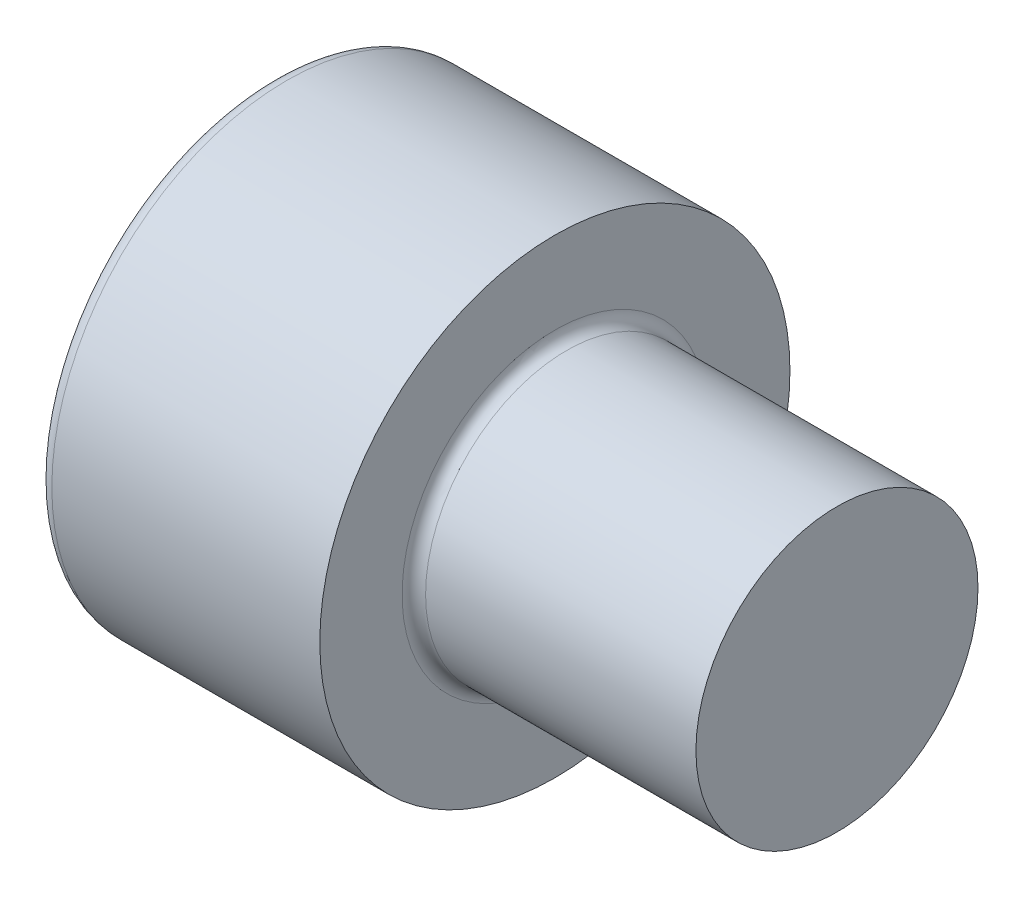
ISO-10303-21;
HEADER;
FILE_DESCRIPTION(('STEP AP214'),'2;1');
FILE_NAME('part.step','',(''),(''),'','','');
FILE_SCHEMA(('AUTOMOTIVE_DESIGN { 1 0 10303 214 1 1 1 1 }'));
ENDSEC;
DATA;
#1=APPLICATION_CONTEXT('core data for automotive mechanical design processes');
#2=APPLICATION_PROTOCOL_DEFINITION('international standard','automotive_design',2000,#1);
#3=PRODUCT_CONTEXT('',#1,'mechanical');
#4=PRODUCT('Part','Part','',(#3));
#5=PRODUCT_RELATED_PRODUCT_CATEGORY('part','',(#4));
#6=PRODUCT_DEFINITION_FORMATION('','',#4);
#7=PRODUCT_DEFINITION_CONTEXT('part definition',#1,'design');
#8=PRODUCT_DEFINITION('design','',#6,#7);
#9=PRODUCT_DEFINITION_SHAPE('','',#8);
#10=(LENGTH_UNIT() NAMED_UNIT(*) SI_UNIT(.MILLI.,.METRE.));
#11=(NAMED_UNIT(*) PLANE_ANGLE_UNIT() SI_UNIT($,.RADIAN.));
#12=(NAMED_UNIT(*) SI_UNIT($,.STERADIAN.) SOLID_ANGLE_UNIT());
#13=UNCERTAINTY_MEASURE_WITH_UNIT(LENGTH_MEASURE(1.E-05),#10,'distance_accuracy_value','');
#14=(GEOMETRIC_REPRESENTATION_CONTEXT(3) GLOBAL_UNCERTAINTY_ASSIGNED_CONTEXT((#13)) GLOBAL_UNIT_ASSIGNED_CONTEXT((#10,
#11,#12)) REPRESENTATION_CONTEXT('',''));
#15=CARTESIAN_POINT('',(0.,0.,0.));
#16=DIRECTION('',(0.,0.,1.));
#17=DIRECTION('',(1.,0.,0.));
#18=AXIS2_PLACEMENT_3D('',#15,#16,#17);
#19=CARTESIAN_POINT('',(-31.75,0.,0.));
#20=DIRECTION('',(-1.,0.,0.));
#21=DIRECTION('',(0.,0.,1.));
#22=AXIS2_PLACEMENT_3D('',#19,#20,#21);
#23=CYLINDRICAL_SURFACE('',#22,3.);
#24=CARTESIAN_POINT('',(6.25,0.,0.));
#25=DIRECTION('',(1.,0.,0.));
#26=DIRECTION('',(0.,0.,-1.));
#27=AXIS2_PLACEMENT_3D('',#24,#25,#26);
#28=CIRCLE('',#27,3.);
#29=CARTESIAN_POINT('',(6.25,0.,-3.));
#30=VERTEX_POINT('',#29);
#31=EDGE_CURVE('E149',#30,#30,#28,.T.);
#32=ORIENTED_EDGE('',*,*,#31,.T.);
#33=EDGE_LOOP('',(#32));
#34=FACE_BOUND('',#33,.T.);
#35=CARTESIAN_POINT('',(12.,0.,0.));
#36=DIRECTION('',(1.,0.,0.));
#37=DIRECTION('',(0.,0.,-1.));
#38=AXIS2_PLACEMENT_3D('',#35,#36,#37);
#39=CIRCLE('',#38,3.);
#40=CARTESIAN_POINT('',(12.,0.,-3.));
#41=VERTEX_POINT('',#40);
#42=EDGE_CURVE('E38',#41,#41,#39,.F.);
#43=ORIENTED_EDGE('',*,*,#42,.T.);
#44=EDGE_LOOP('',(#43));
#45=FACE_BOUND('',#44,.T.);
#46=ADVANCED_FACE('F34',(#34,#45),#23,.T.);
#47=CARTESIAN_POINT('',(0.,0.,0.));
#48=DIRECTION('',(-1.,0.,0.));
#49=DIRECTION('',(0.,0.,1.));
#50=AXIS2_PLACEMENT_3D('',#47,#48,#49);
#51=PLANE('',#50);
#52=DIRECTION('',(0.,-0.499999999999999,0.866025403784439));
#53=VECTOR('',#52,1.);
#54=CARTESIAN_POINT('',(0.,2.93524876856005,0.));
#55=LINE('',#54,#53);
#56=CARTESIAN_POINT('',(0.,2.93524876856005,0.));
#57=VERTEX_POINT('',#56);
#58=CARTESIAN_POINT('',(0.,1.46762438428003,2.54199999999999));
#59=VERTEX_POINT('',#58);
#60=EDGE_CURVE('E345',#57,#59,#55,.T.);
#61=ORIENTED_EDGE('',*,*,#60,.T.);
#62=DIRECTION('',(0.,1.,0.));
#63=VECTOR('',#62,1.);
#64=CARTESIAN_POINT('',(0.,-1.46762438428003,2.542));
#65=LINE('',#64,#63);
#66=CARTESIAN_POINT('',(0.,-1.46762438428003,2.542));
#67=VERTEX_POINT('',#66);
#68=EDGE_CURVE('E131',#67,#59,#65,.T.);
#69=ORIENTED_EDGE('',*,*,#68,.F.);
#70=DIRECTION('',(0.,-0.500000000000001,-0.866025403784438));
#71=VECTOR('',#70,1.);
#72=CARTESIAN_POINT('',(0.,-1.46762438428003,2.542));
#73=LINE('',#72,#71);
#74=CARTESIAN_POINT('',(0.,-2.93524876856006,0.));
#75=VERTEX_POINT('',#74);
#76=EDGE_CURVE('E348',#67,#75,#73,.T.);
#77=ORIENTED_EDGE('',*,*,#76,.T.);
#78=DIRECTION('',(0.,0.499999999999999,-0.866025403784439));
#79=VECTOR('',#78,1.);
#80=CARTESIAN_POINT('',(0.,-2.93524876856006,0.));
#81=LINE('',#80,#79);
#82=CARTESIAN_POINT('',(0.,-1.46762438428003,-2.542));
#83=VERTEX_POINT('',#82);
#84=EDGE_CURVE('E356',#75,#83,#81,.T.);
#85=ORIENTED_EDGE('',*,*,#84,.T.);
#86=DIRECTION('',(0.,-1.,0.));
#87=VECTOR('',#86,1.);
#88=CARTESIAN_POINT('',(0.,1.46762438428002,-2.542));
#89=LINE('',#88,#87);
#90=CARTESIAN_POINT('',(0.,1.46762438428002,-2.542));
#91=VERTEX_POINT('',#90);
#92=EDGE_CURVE('E359',#91,#83,#89,.T.);
#93=ORIENTED_EDGE('',*,*,#92,.F.);
#94=DIRECTION('',(0.,-0.500000000000001,-0.866025403784438));
#95=VECTOR('',#94,1.);
#96=CARTESIAN_POINT('',(0.,2.93524876856005,0.));
#97=LINE('',#96,#95);
#98=EDGE_CURVE('E126',#57,#91,#97,.T.);
#99=ORIENTED_EDGE('',*,*,#98,.F.);
#100=EDGE_LOOP('',(#61,#69,#77,#85,#93,#99));
#101=FACE_BOUND('',#100,.T.);
#102=CARTESIAN_POINT('',(0.,0.,0.));
#103=DIRECTION('',(-1.,0.,0.));
#104=DIRECTION('',(0.,0.,1.));
#105=AXIS2_PLACEMENT_3D('',#102,#103,#104);
#106=CIRCLE('',#105,4.7);
#107=CARTESIAN_POINT('',(0.,0.,4.7));
#108=VERTEX_POINT('',#107);
#109=EDGE_CURVE('E43',#108,#108,#106,.T.);
#110=ORIENTED_EDGE('',*,*,#109,.T.);
#111=EDGE_LOOP('',(#110));
#112=FACE_BOUND('',#111,.T.);
#113=ADVANCED_FACE('F155',(#101,#112),#51,.T.);
#114=CARTESIAN_POINT('',(-31.75,0.,0.));
#115=DIRECTION('',(-1.,0.,0.));
#116=DIRECTION('',(0.,0.,1.));
#117=AXIS2_PLACEMENT_3D('',#114,#115,#116);
#118=CYLINDRICAL_SURFACE('',#117,5.);
#119=CARTESIAN_POINT('',(0.300000000000002,0.,0.));
#120=DIRECTION('',(-1.,0.,0.));
#121=DIRECTION('',(0.,0.,1.));
#122=AXIS2_PLACEMENT_3D('',#119,#120,#121);
#123=CIRCLE('',#122,5.);
#124=CARTESIAN_POINT('',(0.300000000000002,0.,5.));
#125=VERTEX_POINT('',#124);
#126=EDGE_CURVE('E11',#125,#125,#123,.F.);
#127=ORIENTED_EDGE('',*,*,#126,.T.);
#128=EDGE_LOOP('',(#127));
#129=FACE_BOUND('',#128,.T.);
#130=CARTESIAN_POINT('',(6.,0.,0.));
#131=DIRECTION('',(-1.,0.,0.));
#132=DIRECTION('',(0.,0.,1.));
#133=AXIS2_PLACEMENT_3D('',#130,#131,#132);
#134=CIRCLE('',#133,5.);
#135=CARTESIAN_POINT('',(6.,0.,5.));
#136=VERTEX_POINT('',#135);
#137=EDGE_CURVE('E142',#136,#136,#134,.T.);
#138=ORIENTED_EDGE('',*,*,#137,.T.);
#139=EDGE_LOOP('',(#138));
#140=FACE_BOUND('',#139,.T.);
#141=ADVANCED_FACE('F174',(#129,#140),#118,.T.);
#142=CARTESIAN_POINT('',(6.,5.,0.));
#143=DIRECTION('',(1.,0.,0.));
#144=DIRECTION('',(0.,0.,-1.));
#145=AXIS2_PLACEMENT_3D('',#142,#143,#144);
#146=PLANE('',#145);
#147=CARTESIAN_POINT('',(6.,0.,0.));
#148=DIRECTION('',(1.,0.,0.));
#149=DIRECTION('',(0.,0.,-1.));
#150=AXIS2_PLACEMENT_3D('',#147,#148,#149);
#151=CIRCLE('',#150,3.25);
#152=CARTESIAN_POINT('',(6.,0.,-3.25));
#153=VERTEX_POINT('',#152);
#154=EDGE_CURVE('E146',#153,#153,#151,.F.);
#155=ORIENTED_EDGE('',*,*,#154,.T.);
#156=EDGE_LOOP('',(#155));
#157=FACE_BOUND('',#156,.T.);
#158=ORIENTED_EDGE('',*,*,#137,.F.);
#159=EDGE_LOOP('',(#158));
#160=FACE_BOUND('',#159,.T.);
#161=ADVANCED_FACE('F165',(#157,#160),#146,.T.);
#162=CARTESIAN_POINT('',(6.25,0.,0.));
#163=DIRECTION('',(1.,0.,0.));
#164=DIRECTION('',(0.,0.,-1.));
#165=AXIS2_PLACEMENT_3D('',#162,#163,#164);
#166=TOROIDAL_SURFACE('',#165,3.25,0.25);
#167=ORIENTED_EDGE('',*,*,#31,.F.);
#168=EDGE_LOOP('',(#167));
#169=FACE_BOUND('',#168,.T.);
#170=ORIENTED_EDGE('',*,*,#154,.F.);
#171=EDGE_LOOP('',(#170));
#172=FACE_BOUND('',#171,.T.);
#173=ADVANCED_FACE('F158',(#169,#172),#166,.F.);
#174=CARTESIAN_POINT('',(0.300000000000002,0.,0.));
#175=DIRECTION('',(-1.,0.,0.));
#176=DIRECTION('',(0.,0.,1.));
#177=AXIS2_PLACEMENT_3D('',#174,#175,#176);
#178=TOROIDAL_SURFACE('',#177,4.7,0.3);
#179=ORIENTED_EDGE('',*,*,#126,.F.);
#180=EDGE_LOOP('',(#179));
#181=FACE_BOUND('',#180,.T.);
#182=ORIENTED_EDGE('',*,*,#109,.F.);
#183=EDGE_LOOP('',(#182));
#184=FACE_BOUND('',#183,.T.);
#185=ADVANCED_FACE('F36',(#181,#184),#178,.T.);
#186=CARTESIAN_POINT('',(3.,2.93524876856005,0.));
#187=DIRECTION('',(0.,-0.866025403784439,-0.499999999999999));
#188=DIRECTION('',(0.,0.499999999999999,-0.866025403784439));
#189=AXIS2_PLACEMENT_3D('',#186,#187,#188);
#190=PLANE('',#189);
#191=ORIENTED_EDGE('',*,*,#60,.F.);
#192=DIRECTION('',(-1.,0.,0.));
#193=VECTOR('',#192,1.);
#194=CARTESIAN_POINT('',(3.,2.93524876856005,0.));
#195=LINE('',#194,#193);
#196=CARTESIAN_POINT('',(3.,2.93524876856005,0.));
#197=VERTEX_POINT('',#196);
#198=EDGE_CURVE('E363',#197,#57,#195,.T.);
#199=ORIENTED_EDGE('',*,*,#198,.F.);
#200=DIRECTION('',(0.,-0.499999999999999,0.866025403784439));
#201=VECTOR('',#200,1.);
#202=CARTESIAN_POINT('',(3.,2.93524876856005,0.));
#203=LINE('',#202,#201);
#204=CARTESIAN_POINT('',(3.,2.20143657642004,1.271));
#205=VERTEX_POINT('',#204);
#206=EDGE_CURVE('E118',#197,#205,#203,.T.);
#207=ORIENTED_EDGE('',*,*,#206,.T.);
#208=CARTESIAN_POINT('',(3.,1.46762438428003,2.54199999999999));
#209=VERTEX_POINT('',#208);
#210=EDGE_CURVE('E109',#205,#209,#203,.T.);
#211=ORIENTED_EDGE('',*,*,#210,.T.);
#212=DIRECTION('',(-1.,0.,0.));
#213=VECTOR('',#212,1.);
#214=CARTESIAN_POINT('',(3.,1.46762438428003,2.54199999999999));
#215=LINE('',#214,#213);
#216=EDGE_CURVE('E123',#209,#59,#215,.T.);
#217=ORIENTED_EDGE('',*,*,#216,.T.);
#218=EDGE_LOOP('',(#191,#199,#207,#211,#217));
#219=FACE_BOUND('',#218,.T.);
#220=ADVANCED_FACE('F122',(#219),#190,.T.);
#221=CARTESIAN_POINT('',(3.,-1.46762438428003,2.542));
#222=DIRECTION('',(0.,0.,1.));
#223=DIRECTION('',(0.,-1.,0.));
#224=AXIS2_PLACEMENT_3D('',#221,#222,#223);
#225=PLANE('',#224);
#226=ORIENTED_EDGE('',*,*,#68,.T.);
#227=ORIENTED_EDGE('',*,*,#216,.F.);
#228=DIRECTION('',(0.,1.,0.));
#229=VECTOR('',#228,1.);
#230=CARTESIAN_POINT('',(3.,-1.46762438428003,2.542));
#231=LINE('',#230,#229);
#232=CARTESIAN_POINT('',(3.,0.,2.542));
#233=VERTEX_POINT('',#232);
#234=EDGE_CURVE('E106',#233,#209,#231,.T.);
#235=ORIENTED_EDGE('',*,*,#234,.F.);
#236=CARTESIAN_POINT('',(3.,-1.46762438428003,2.542));
#237=VERTEX_POINT('',#236);
#238=EDGE_CURVE('E117',#237,#233,#231,.T.);
#239=ORIENTED_EDGE('',*,*,#238,.F.);
#240=DIRECTION('',(-1.,0.,0.));
#241=VECTOR('',#240,1.);
#242=CARTESIAN_POINT('',(3.,-1.46762438428003,2.542));
#243=LINE('',#242,#241);
#244=EDGE_CURVE('E133',#237,#67,#243,.T.);
#245=ORIENTED_EDGE('',*,*,#244,.T.);
#246=EDGE_LOOP('',(#226,#227,#235,#239,#245));
#247=FACE_BOUND('',#246,.T.);
#248=ADVANCED_FACE('F128',(#247),#225,.F.);
#249=CARTESIAN_POINT('',(3.,-1.46762438428003,2.542));
#250=DIRECTION('',(0.,0.866025403784438,-0.500000000000001));
#251=DIRECTION('',(0.,0.500000000000001,0.866025403784438));
#252=AXIS2_PLACEMENT_3D('',#249,#250,#251);
#253=PLANE('',#252);
#254=ORIENTED_EDGE('',*,*,#76,.F.);
#255=ORIENTED_EDGE('',*,*,#244,.F.);
#256=DIRECTION('',(0.,-0.500000000000001,-0.866025403784438));
#257=VECTOR('',#256,1.);
#258=CARTESIAN_POINT('',(3.,-1.46762438428003,2.542));
#259=LINE('',#258,#257);
#260=CARTESIAN_POINT('',(3.,-2.20143657642004,1.271));
#261=VERTEX_POINT('',#260);
#262=EDGE_CURVE('E391',#237,#261,#259,.T.);
#263=ORIENTED_EDGE('',*,*,#262,.T.);
#264=CARTESIAN_POINT('',(3.,-2.93524876856006,0.));
#265=VERTEX_POINT('',#264);
#266=EDGE_CURVE('E375',#261,#265,#259,.T.);
#267=ORIENTED_EDGE('',*,*,#266,.T.);
#268=DIRECTION('',(-1.,0.,0.));
#269=VECTOR('',#268,1.);
#270=CARTESIAN_POINT('',(3.,-2.93524876856006,0.));
#271=LINE('',#270,#269);
#272=EDGE_CURVE('E138',#265,#75,#271,.T.);
#273=ORIENTED_EDGE('',*,*,#272,.T.);
#274=EDGE_LOOP('',(#254,#255,#263,#267,#273));
#275=FACE_BOUND('',#274,.T.);
#276=ADVANCED_FACE('F236',(#275),#253,.T.);
#277=CARTESIAN_POINT('',(3.,-2.93524876856006,0.));
#278=DIRECTION('',(0.,0.866025403784439,0.499999999999999));
#279=DIRECTION('',(0.,-0.499999999999999,0.866025403784439));
#280=AXIS2_PLACEMENT_3D('',#277,#278,#279);
#281=PLANE('',#280);
#282=ORIENTED_EDGE('',*,*,#84,.F.);
#283=ORIENTED_EDGE('',*,*,#272,.F.);
#284=DIRECTION('',(0.,0.499999999999999,-0.866025403784439));
#285=VECTOR('',#284,1.);
#286=CARTESIAN_POINT('',(3.,-2.93524876856006,0.));
#287=LINE('',#286,#285);
#288=CARTESIAN_POINT('',(3.,-2.20143657642005,-1.271));
#289=VERTEX_POINT('',#288);
#290=EDGE_CURVE('E393',#265,#289,#287,.T.);
#291=ORIENTED_EDGE('',*,*,#290,.T.);
#292=CARTESIAN_POINT('',(3.,-1.46762438428003,-2.542));
#293=VERTEX_POINT('',#292);
#294=EDGE_CURVE('E381',#289,#293,#287,.T.);
#295=ORIENTED_EDGE('',*,*,#294,.T.);
#296=DIRECTION('',(-1.,0.,0.));
#297=VECTOR('',#296,1.);
#298=CARTESIAN_POINT('',(3.,-1.46762438428003,-2.542));
#299=LINE('',#298,#297);
#300=EDGE_CURVE('E369',#293,#83,#299,.T.);
#301=ORIENTED_EDGE('',*,*,#300,.T.);
#302=EDGE_LOOP('',(#282,#283,#291,#295,#301));
#303=FACE_BOUND('',#302,.T.);
#304=ADVANCED_FACE('F244',(#303),#281,.T.);
#305=CARTESIAN_POINT('',(3.,1.46762438428002,-2.542));
#306=DIRECTION('',(0.,0.,-1.));
#307=DIRECTION('',(0.,1.,0.));
#308=AXIS2_PLACEMENT_3D('',#305,#306,#307);
#309=PLANE('',#308);
#310=ORIENTED_EDGE('',*,*,#92,.T.);
#311=ORIENTED_EDGE('',*,*,#300,.F.);
#312=DIRECTION('',(0.,-1.,0.));
#313=VECTOR('',#312,1.);
#314=CARTESIAN_POINT('',(3.,1.46762438428002,-2.542));
#315=LINE('',#314,#313);
#316=CARTESIAN_POINT('',(3.,0.,-2.542));
#317=VERTEX_POINT('',#316);
#318=EDGE_CURVE('E382',#317,#293,#315,.T.);
#319=ORIENTED_EDGE('',*,*,#318,.F.);
#320=CARTESIAN_POINT('',(3.,1.46762438428002,-2.542));
#321=VERTEX_POINT('',#320);
#322=EDGE_CURVE('E50',#321,#317,#315,.T.);
#323=ORIENTED_EDGE('',*,*,#322,.F.);
#324=DIRECTION('',(-1.,0.,0.));
#325=VECTOR('',#324,1.);
#326=CARTESIAN_POINT('',(3.,1.46762438428002,-2.542));
#327=LINE('',#326,#325);
#328=EDGE_CURVE('E366',#321,#91,#327,.T.);
#329=ORIENTED_EDGE('',*,*,#328,.T.);
#330=EDGE_LOOP('',(#310,#311,#319,#323,#329));
#331=FACE_BOUND('',#330,.T.);
#332=ADVANCED_FACE('F253',(#331),#309,.F.);
#333=CARTESIAN_POINT('',(3.,2.93524876856005,0.));
#334=DIRECTION('',(0.,0.866025403784438,-0.500000000000001));
#335=DIRECTION('',(0.,0.500000000000001,0.866025403784438));
#336=AXIS2_PLACEMENT_3D('',#333,#334,#335);
#337=PLANE('',#336);
#338=ORIENTED_EDGE('',*,*,#98,.T.);
#339=ORIENTED_EDGE('',*,*,#328,.F.);
#340=DIRECTION('',(0.,-0.500000000000001,-0.866025403784438));
#341=VECTOR('',#340,1.);
#342=CARTESIAN_POINT('',(3.,2.93524876856005,0.));
#343=LINE('',#342,#341);
#344=CARTESIAN_POINT('',(3.,2.20143657642004,-1.271));
#345=VERTEX_POINT('',#344);
#346=EDGE_CURVE('E387',#345,#321,#343,.T.);
#347=ORIENTED_EDGE('',*,*,#346,.F.);
#348=EDGE_CURVE('E351',#197,#345,#343,.T.);
#349=ORIENTED_EDGE('',*,*,#348,.F.);
#350=ORIENTED_EDGE('',*,*,#198,.T.);
#351=EDGE_LOOP('',(#338,#339,#347,#349,#350));
#352=FACE_BOUND('',#351,.T.);
#353=ADVANCED_FACE('F262',(#352),#337,.F.);
#354=CARTESIAN_POINT('',(3.,2.93524876856005,0.));
#355=DIRECTION('',(1.,0.,0.));
#356=DIRECTION('',(0.,0.,-1.));
#357=AXIS2_PLACEMENT_3D('',#354,#355,#356);
#358=PLANE('',#357);
#359=ORIENTED_EDGE('',*,*,#318,.T.);
#360=ORIENTED_EDGE('',*,*,#294,.F.);
#361=CARTESIAN_POINT('',(3.,0.,0.));
#362=DIRECTION('',(-1.,0.,0.));
#363=DIRECTION('',(0.,0.,1.));
#364=AXIS2_PLACEMENT_3D('',#361,#362,#363);
#365=CIRCLE('',#364,2.542);
#366=EDGE_CURVE('E395',#317,#289,#365,.T.);
#367=ORIENTED_EDGE('',*,*,#366,.F.);
#368=EDGE_LOOP('',(#359,#360,#367));
#369=FACE_BOUND('',#368,.T.);
#370=ADVANCED_FACE('F271',(#369),#358,.F.);
#371=ORIENTED_EDGE('',*,*,#290,.F.);
#372=ORIENTED_EDGE('',*,*,#266,.F.);
#373=EDGE_CURVE('E136',#289,#261,#365,.T.);
#374=ORIENTED_EDGE('',*,*,#373,.F.);
#375=EDGE_LOOP('',(#371,#372,#374));
#376=FACE_BOUND('',#375,.T.);
#377=ADVANCED_FACE('F280',(#376),#358,.F.);
#378=ORIENTED_EDGE('',*,*,#262,.F.);
#379=ORIENTED_EDGE('',*,*,#238,.T.);
#380=EDGE_CURVE('E132',#261,#233,#365,.T.);
#381=ORIENTED_EDGE('',*,*,#380,.F.);
#382=EDGE_LOOP('',(#378,#379,#381));
#383=FACE_BOUND('',#382,.T.);
#384=ADVANCED_FACE('F289',(#383),#358,.F.);
#385=ORIENTED_EDGE('',*,*,#234,.T.);
#386=ORIENTED_EDGE('',*,*,#210,.F.);
#387=EDGE_CURVE('E112',#233,#205,#365,.T.);
#388=ORIENTED_EDGE('',*,*,#387,.F.);
#389=EDGE_LOOP('',(#385,#386,#388));
#390=FACE_BOUND('',#389,.T.);
#391=ADVANCED_FACE('F108',(#390),#358,.F.);
#392=ORIENTED_EDGE('',*,*,#206,.F.);
#393=ORIENTED_EDGE('',*,*,#348,.T.);
#394=EDGE_CURVE('E143',#205,#345,#365,.T.);
#395=ORIENTED_EDGE('',*,*,#394,.F.);
#396=EDGE_LOOP('',(#392,#393,#395));
#397=FACE_BOUND('',#396,.T.);
#398=ADVANCED_FACE('F304',(#397),#358,.F.);
#399=ORIENTED_EDGE('',*,*,#346,.T.);
#400=ORIENTED_EDGE('',*,*,#322,.T.);
#401=EDGE_CURVE('E399',#345,#317,#365,.T.);
#402=ORIENTED_EDGE('',*,*,#401,.F.);
#403=EDGE_LOOP('',(#399,#400,#402));
#404=FACE_BOUND('',#403,.T.);
#405=ADVANCED_FACE('F218',(#404),#358,.F.);
#406=CARTESIAN_POINT('',(3.,0.,0.));
#407=DIRECTION('',(-1.,0.,0.));
#408=DIRECTION('',(0.,0.,1.));
#409=AXIS2_PLACEMENT_3D('',#406,#407,#408);
#410=CONICAL_SURFACE('',#409,2.542,1.04719755119659);
#411=CARTESIAN_POINT('',(4.46762438428005,0.,0.));
#412=VERTEX_POINT('',#411);
#413=VERTEX_LOOP('',#412);
#414=FACE_BOUND('',#413,.T.);
#415=ORIENTED_EDGE('',*,*,#387,.T.);
#416=ORIENTED_EDGE('',*,*,#394,.T.);
#417=ORIENTED_EDGE('',*,*,#401,.T.);
#418=ORIENTED_EDGE('',*,*,#366,.T.);
#419=ORIENTED_EDGE('',*,*,#373,.T.);
#420=ORIENTED_EDGE('',*,*,#380,.T.);
#421=EDGE_LOOP('',(#415,#416,#417,#418,#419,#420));
#422=FACE_BOUND('',#421,.T.);
#423=ADVANCED_FACE('F180',(#414,#422),#410,.F.);
#424=CARTESIAN_POINT('',(12.,0.,0.));
#425=DIRECTION('',(1.,0.,0.));
#426=DIRECTION('',(0.,0.,-1.));
#427=AXIS2_PLACEMENT_3D('',#424,#425,#426);
#428=PLANE('',#427);
#429=ORIENTED_EDGE('',*,*,#42,.F.);
#430=EDGE_LOOP('',(#429));
#431=FACE_BOUND('',#430,.T.);
#432=ADVANCED_FACE('F217',(#431),#428,.T.);
#433=CLOSED_SHELL('',(#46,#113,#141,#161,#173,#185,#220,#248,#276,#304,#332,#353,#370,#377,#384,
#391,#398,#405,#423,#432));
#434=MANIFOLD_SOLID_BREP('B2',#433);
#435=ADVANCED_BREP_SHAPE_REPRESENTATION('',(#18,#434),#14);
#436=SHAPE_DEFINITION_REPRESENTATION(#9,#435);
ENDSEC;
END-ISO-10303-21;
